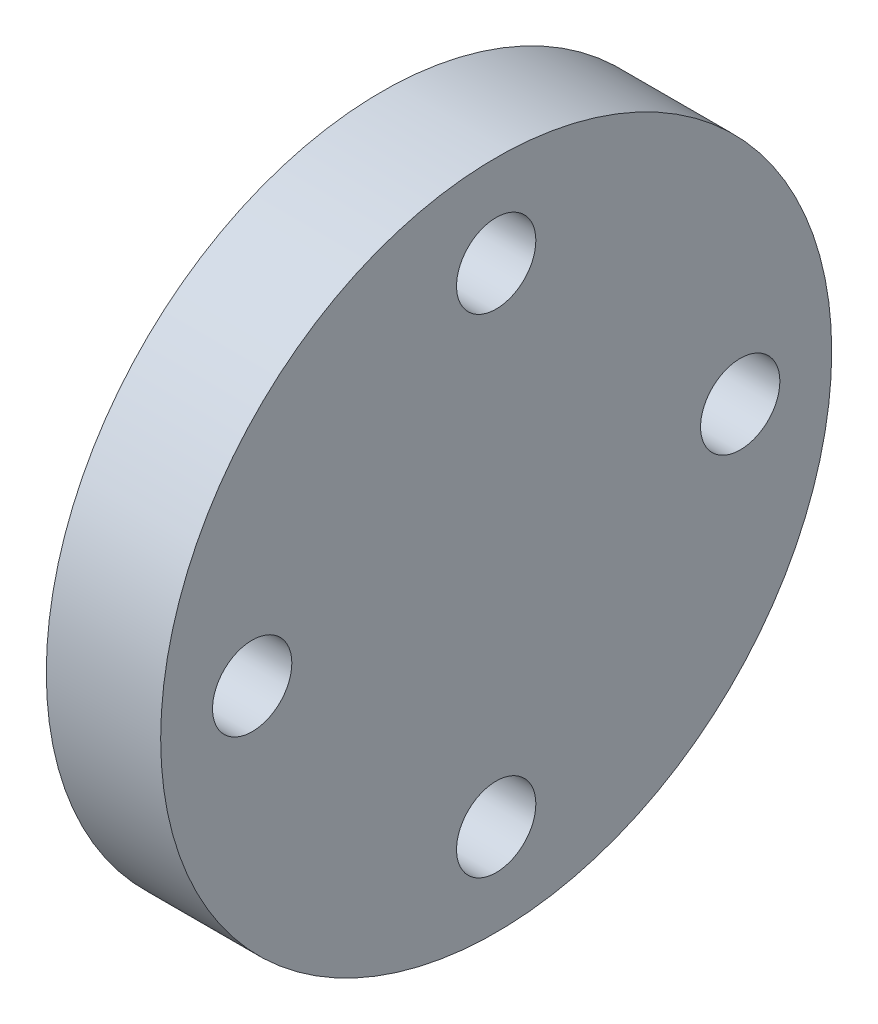
ISO-10303-21;
HEADER;
FILE_DESCRIPTION(('STEP AP214'),'2;1');
FILE_NAME('part.step','',(''),(''),'','','');
FILE_SCHEMA(('AUTOMOTIVE_DESIGN { 1 0 10303 214 1 1 1 1 }'));
ENDSEC;
DATA;
#1=APPLICATION_CONTEXT('core data for automotive mechanical design processes');
#2=APPLICATION_PROTOCOL_DEFINITION('international standard','automotive_design',2000,#1);
#3=PRODUCT_CONTEXT('',#1,'mechanical');
#4=PRODUCT('Part','Part','',(#3));
#5=PRODUCT_RELATED_PRODUCT_CATEGORY('part','',(#4));
#6=PRODUCT_DEFINITION_FORMATION('','',#4);
#7=PRODUCT_DEFINITION_CONTEXT('part definition',#1,'design');
#8=PRODUCT_DEFINITION('design','',#6,#7);
#9=PRODUCT_DEFINITION_SHAPE('','',#8);
#10=(LENGTH_UNIT() NAMED_UNIT(*) SI_UNIT(.MILLI.,.METRE.));
#11=(NAMED_UNIT(*) PLANE_ANGLE_UNIT() SI_UNIT($,.RADIAN.));
#12=(NAMED_UNIT(*) SI_UNIT($,.STERADIAN.) SOLID_ANGLE_UNIT());
#13=UNCERTAINTY_MEASURE_WITH_UNIT(LENGTH_MEASURE(1.E-05),#10,'distance_accuracy_value','');
#14=(GEOMETRIC_REPRESENTATION_CONTEXT(3) GLOBAL_UNCERTAINTY_ASSIGNED_CONTEXT((#13)) GLOBAL_UNIT_ASSIGNED_CONTEXT((#10,
#11,#12)) REPRESENTATION_CONTEXT('',''));
#15=CARTESIAN_POINT('',(0.,0.,0.));
#16=DIRECTION('',(0.,0.,1.));
#17=DIRECTION('',(1.,0.,0.));
#18=AXIS2_PLACEMENT_3D('',#15,#16,#17);
#19=CARTESIAN_POINT('',(4.7625,0.,0.));
#20=DIRECTION('',(1.,0.,0.));
#21=DIRECTION('',(0.,0.,-1.));
#22=AXIS2_PLACEMENT_3D('',#19,#20,#21);
#23=PLANE('',#22);
#24=CARTESIAN_POINT('',(4.7625,0.,-10.16));
#25=DIRECTION('',(1.,0.,0.));
#26=DIRECTION('',(0.,0.,-1.));
#27=AXIS2_PLACEMENT_3D('',#24,#25,#26);
#28=CIRCLE('',#27,1.651);
#29=CARTESIAN_POINT('',(4.7625,0.,-11.811));
#30=VERTEX_POINT('',#29);
#31=EDGE_CURVE('E58',#30,#30,#28,.T.);
#32=ORIENTED_EDGE('',*,*,#31,.F.);
#33=EDGE_LOOP('',(#32));
#34=FACE_BOUND('',#33,.T.);
#35=CARTESIAN_POINT('',(4.7625,0.,10.16));
#36=DIRECTION('',(1.,0.,0.));
#37=DIRECTION('',(0.,0.,-1.));
#38=AXIS2_PLACEMENT_3D('',#35,#36,#37);
#39=CIRCLE('',#38,1.651);
#40=CARTESIAN_POINT('',(4.7625,0.,8.509));
#41=VERTEX_POINT('',#40);
#42=EDGE_CURVE('E47',#41,#41,#39,.T.);
#43=ORIENTED_EDGE('',*,*,#42,.F.);
#44=EDGE_LOOP('',(#43));
#45=FACE_BOUND('',#44,.T.);
#46=CARTESIAN_POINT('',(4.7625,0.,0.));
#47=DIRECTION('',(1.,0.,0.));
#48=DIRECTION('',(0.,0.,-1.));
#49=AXIS2_PLACEMENT_3D('',#46,#47,#48);
#50=CIRCLE('',#49,13.97);
#51=CARTESIAN_POINT('',(4.7625,0.,-13.97));
#52=VERTEX_POINT('',#51);
#53=EDGE_CURVE('E10',#52,#52,#50,.T.);
#54=ORIENTED_EDGE('',*,*,#53,.T.);
#55=EDGE_LOOP('',(#54));
#56=FACE_BOUND('',#55,.T.);
#57=CARTESIAN_POINT('',(4.7625,10.16,0.));
#58=DIRECTION('',(1.,0.,0.));
#59=DIRECTION('',(0.,0.,-1.));
#60=AXIS2_PLACEMENT_3D('',#57,#58,#59);
#61=CIRCLE('',#60,1.651);
#62=CARTESIAN_POINT('',(4.7625,10.16,-1.65100000000003));
#63=VERTEX_POINT('',#62);
#64=EDGE_CURVE('E52',#63,#63,#61,.T.);
#65=ORIENTED_EDGE('',*,*,#64,.F.);
#66=EDGE_LOOP('',(#65));
#67=FACE_BOUND('',#66,.T.);
#68=CARTESIAN_POINT('',(4.7625,-10.16,1.06420351207939E-13));
#69=DIRECTION('',(1.,0.,0.));
#70=DIRECTION('',(0.,0.,-1.));
#71=AXIS2_PLACEMENT_3D('',#68,#69,#70);
#72=CIRCLE('',#71,1.651);
#73=CARTESIAN_POINT('',(4.7625,-10.16,-1.65099999999989));
#74=VERTEX_POINT('',#73);
#75=EDGE_CURVE('E64',#74,#74,#72,.T.);
#76=ORIENTED_EDGE('',*,*,#75,.F.);
#77=EDGE_LOOP('',(#76));
#78=FACE_BOUND('',#77,.T.);
#79=ADVANCED_FACE('F36',(#34,#45,#56,#67,#78),#23,.T.);
#80=CARTESIAN_POINT('',(0.,0.,0.));
#81=DIRECTION('',(1.,0.,0.));
#82=DIRECTION('',(0.,0.,-1.));
#83=AXIS2_PLACEMENT_3D('',#80,#81,#82);
#84=PLANE('',#83);
#85=CARTESIAN_POINT('',(0.,0.,0.));
#86=DIRECTION('',(1.,0.,0.));
#87=DIRECTION('',(0.,0.,-1.));
#88=AXIS2_PLACEMENT_3D('',#85,#86,#87);
#89=CIRCLE('',#88,13.97);
#90=CARTESIAN_POINT('',(0.,0.,-13.97));
#91=VERTEX_POINT('',#90);
#92=EDGE_CURVE('E40',#91,#91,#89,.T.);
#93=ORIENTED_EDGE('',*,*,#92,.F.);
#94=EDGE_LOOP('',(#93));
#95=FACE_BOUND('',#94,.T.);
#96=CARTESIAN_POINT('',(0.,0.,10.16));
#97=DIRECTION('',(1.,0.,0.));
#98=DIRECTION('',(0.,0.,-1.));
#99=AXIS2_PLACEMENT_3D('',#96,#97,#98);
#100=CIRCLE('',#99,1.651);
#101=CARTESIAN_POINT('',(0.,0.,8.509));
#102=VERTEX_POINT('',#101);
#103=EDGE_CURVE('E49',#102,#102,#100,.T.);
#104=ORIENTED_EDGE('',*,*,#103,.T.);
#105=EDGE_LOOP('',(#104));
#106=FACE_BOUND('',#105,.T.);
#107=CARTESIAN_POINT('',(0.,10.16,0.));
#108=DIRECTION('',(1.,0.,0.));
#109=DIRECTION('',(0.,0.,-1.));
#110=AXIS2_PLACEMENT_3D('',#107,#108,#109);
#111=CIRCLE('',#110,1.651);
#112=CARTESIAN_POINT('',(0.,10.16,-1.65100000000003));
#113=VERTEX_POINT('',#112);
#114=EDGE_CURVE('E55',#113,#113,#111,.T.);
#115=ORIENTED_EDGE('',*,*,#114,.T.);
#116=EDGE_LOOP('',(#115));
#117=FACE_BOUND('',#116,.T.);
#118=CARTESIAN_POINT('',(0.,0.,-10.16));
#119=DIRECTION('',(1.,0.,0.));
#120=DIRECTION('',(0.,0.,-1.));
#121=AXIS2_PLACEMENT_3D('',#118,#119,#120);
#122=CIRCLE('',#121,1.651);
#123=CARTESIAN_POINT('',(0.,0.,-11.811));
#124=VERTEX_POINT('',#123);
#125=EDGE_CURVE('E61',#124,#124,#122,.T.);
#126=ORIENTED_EDGE('',*,*,#125,.T.);
#127=EDGE_LOOP('',(#126));
#128=FACE_BOUND('',#127,.T.);
#129=CARTESIAN_POINT('',(0.,-10.16,1.06420351207939E-13));
#130=DIRECTION('',(1.,0.,0.));
#131=DIRECTION('',(0.,0.,-1.));
#132=AXIS2_PLACEMENT_3D('',#129,#130,#131);
#133=CIRCLE('',#132,1.651);
#134=CARTESIAN_POINT('',(0.,-10.16,-1.65099999999989));
#135=VERTEX_POINT('',#134);
#136=EDGE_CURVE('E67',#135,#135,#133,.T.);
#137=ORIENTED_EDGE('',*,*,#136,.T.);
#138=EDGE_LOOP('',(#137));
#139=FACE_BOUND('',#138,.T.);
#140=ADVANCED_FACE('F77',(#95,#106,#117,#128,#139),#84,.F.);
#141=CARTESIAN_POINT('',(4.7625,0.,0.));
#142=DIRECTION('',(-1.,0.,0.));
#143=DIRECTION('',(0.,0.,1.));
#144=AXIS2_PLACEMENT_3D('',#141,#142,#143);
#145=CYLINDRICAL_SURFACE('',#144,13.97);
#146=ORIENTED_EDGE('',*,*,#53,.F.);
#147=EDGE_LOOP('',(#146));
#148=FACE_BOUND('',#147,.T.);
#149=ORIENTED_EDGE('',*,*,#92,.T.);
#150=EDGE_LOOP('',(#149));
#151=FACE_BOUND('',#150,.T.);
#152=ADVANCED_FACE('F38',(#148,#151),#145,.T.);
#153=CARTESIAN_POINT('',(4.7625,0.,10.16));
#154=DIRECTION('',(-1.,0.,0.));
#155=DIRECTION('',(0.,0.,1.));
#156=AXIS2_PLACEMENT_3D('',#153,#154,#155);
#157=CYLINDRICAL_SURFACE('',#156,1.651);
#158=ORIENTED_EDGE('',*,*,#42,.T.);
#159=EDGE_LOOP('',(#158));
#160=FACE_BOUND('',#159,.T.);
#161=ORIENTED_EDGE('',*,*,#103,.F.);
#162=EDGE_LOOP('',(#161));
#163=FACE_BOUND('',#162,.T.);
#164=ADVANCED_FACE('F87',(#160,#163),#157,.F.);
#165=CARTESIAN_POINT('',(4.7625,10.16,0.));
#166=DIRECTION('',(-1.,0.,0.));
#167=DIRECTION('',(0.,0.,1.));
#168=AXIS2_PLACEMENT_3D('',#165,#166,#167);
#169=CYLINDRICAL_SURFACE('',#168,1.651);
#170=ORIENTED_EDGE('',*,*,#64,.T.);
#171=EDGE_LOOP('',(#170));
#172=FACE_BOUND('',#171,.T.);
#173=ORIENTED_EDGE('',*,*,#114,.F.);
#174=EDGE_LOOP('',(#173));
#175=FACE_BOUND('',#174,.T.);
#176=ADVANCED_FACE('F90',(#172,#175),#169,.F.);
#177=CARTESIAN_POINT('',(4.7625,0.,-10.16));
#178=DIRECTION('',(-1.,0.,0.));
#179=DIRECTION('',(0.,0.,1.));
#180=AXIS2_PLACEMENT_3D('',#177,#178,#179);
#181=CYLINDRICAL_SURFACE('',#180,1.651);
#182=ORIENTED_EDGE('',*,*,#31,.T.);
#183=EDGE_LOOP('',(#182));
#184=FACE_BOUND('',#183,.T.);
#185=ORIENTED_EDGE('',*,*,#125,.F.);
#186=EDGE_LOOP('',(#185));
#187=FACE_BOUND('',#186,.T.);
#188=ADVANCED_FACE('F94',(#184,#187),#181,.F.);
#189=CARTESIAN_POINT('',(4.7625,-10.16,1.06420351207939E-13));
#190=DIRECTION('',(-1.,0.,0.));
#191=DIRECTION('',(0.,0.,1.));
#192=AXIS2_PLACEMENT_3D('',#189,#190,#191);
#193=CYLINDRICAL_SURFACE('',#192,1.651);
#194=ORIENTED_EDGE('',*,*,#75,.T.);
#195=EDGE_LOOP('',(#194));
#196=FACE_BOUND('',#195,.T.);
#197=ORIENTED_EDGE('',*,*,#136,.F.);
#198=EDGE_LOOP('',(#197));
#199=FACE_BOUND('',#198,.T.);
#200=ADVANCED_FACE('F73',(#196,#199),#193,.F.);
#201=CLOSED_SHELL('',(#79,#140,#152,#164,#176,#188,#200));
#202=MANIFOLD_SOLID_BREP('B2',#201);
#203=ADVANCED_BREP_SHAPE_REPRESENTATION('',(#18,#202),#14);
#204=SHAPE_DEFINITION_REPRESENTATION(#9,#203);
ENDSEC;
END-ISO-10303-21;
